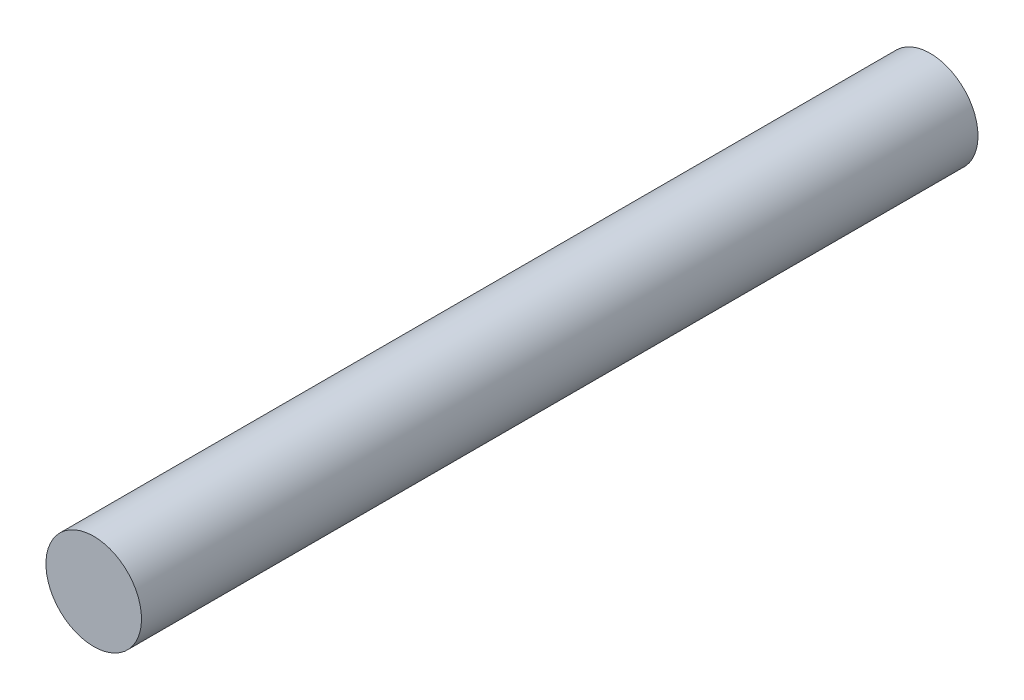
ISO-10303-21;
HEADER;
FILE_DESCRIPTION(('STEP AP214'),'2;1');
FILE_NAME('part.step','',(''),(''),'','','');
FILE_SCHEMA(('AUTOMOTIVE_DESIGN { 1 0 10303 214 1 1 1 1 }'));
ENDSEC;
DATA;
#1=APPLICATION_CONTEXT('core data for automotive mechanical design processes');
#2=APPLICATION_PROTOCOL_DEFINITION('international standard','automotive_design',2000,#1);
#3=PRODUCT_CONTEXT('',#1,'mechanical');
#4=PRODUCT('Part','Part','',(#3));
#5=PRODUCT_RELATED_PRODUCT_CATEGORY('part','',(#4));
#6=PRODUCT_DEFINITION_FORMATION('','',#4);
#7=PRODUCT_DEFINITION_CONTEXT('part definition',#1,'design');
#8=PRODUCT_DEFINITION('design','',#6,#7);
#9=PRODUCT_DEFINITION_SHAPE('','',#8);
#10=(LENGTH_UNIT() NAMED_UNIT(*) SI_UNIT(.MILLI.,.METRE.));
#11=(NAMED_UNIT(*) PLANE_ANGLE_UNIT() SI_UNIT($,.RADIAN.));
#12=(NAMED_UNIT(*) SI_UNIT($,.STERADIAN.) SOLID_ANGLE_UNIT());
#13=UNCERTAINTY_MEASURE_WITH_UNIT(LENGTH_MEASURE(1.E-05),#10,'distance_accuracy_value','');
#14=(GEOMETRIC_REPRESENTATION_CONTEXT(3) GLOBAL_UNCERTAINTY_ASSIGNED_CONTEXT((#13)) GLOBAL_UNIT_ASSIGNED_CONTEXT((#10,
#11,#12)) REPRESENTATION_CONTEXT('',''));
#15=CARTESIAN_POINT('',(0.,0.,0.));
#16=DIRECTION('',(0.,0.,1.));
#17=DIRECTION('',(1.,0.,0.));
#18=AXIS2_PLACEMENT_3D('',#15,#16,#17);
#19=CARTESIAN_POINT('',(0.,0.,70.));
#20=DIRECTION('',(0.,0.,-1.));
#21=DIRECTION('',(-1.,0.,0.));
#22=AXIS2_PLACEMENT_3D('',#19,#20,#21);
#23=CYLINDRICAL_SURFACE('',#22,4.);
#24=CARTESIAN_POINT('',(0.,0.,70.));
#25=DIRECTION('',(0.,0.,1.));
#26=DIRECTION('',(1.,0.,0.));
#27=AXIS2_PLACEMENT_3D('',#24,#25,#26);
#28=CIRCLE('',#27,4.);
#29=CARTESIAN_POINT('',(4.,0.,70.));
#30=VERTEX_POINT('',#29);
#31=EDGE_CURVE('E10',#30,#30,#28,.T.);
#32=ORIENTED_EDGE('',*,*,#31,.F.);
#33=EDGE_LOOP('',(#32));
#34=FACE_BOUND('',#33,.T.);
#35=CARTESIAN_POINT('',(0.,0.,0.));
#36=DIRECTION('',(0.,0.,1.));
#37=DIRECTION('',(1.,0.,0.));
#38=AXIS2_PLACEMENT_3D('',#35,#36,#37);
#39=CIRCLE('',#38,4.);
#40=CARTESIAN_POINT('',(4.,0.,0.));
#41=VERTEX_POINT('',#40);
#42=EDGE_CURVE('E33',#41,#41,#39,.T.);
#43=ORIENTED_EDGE('',*,*,#42,.T.);
#44=EDGE_LOOP('',(#43));
#45=FACE_BOUND('',#44,.T.);
#46=ADVANCED_FACE('F30',(#34,#45),#23,.T.);
#47=CARTESIAN_POINT('',(0.,0.,70.));
#48=DIRECTION('',(0.,0.,1.));
#49=DIRECTION('',(1.,0.,0.));
#50=AXIS2_PLACEMENT_3D('',#47,#48,#49);
#51=PLANE('',#50);
#52=ORIENTED_EDGE('',*,*,#31,.T.);
#53=EDGE_LOOP('',(#52));
#54=FACE_BOUND('',#53,.T.);
#55=ADVANCED_FACE('F45',(#54),#51,.T.);
#56=CARTESIAN_POINT('',(0.,0.,0.));
#57=DIRECTION('',(0.,0.,1.));
#58=DIRECTION('',(1.,0.,0.));
#59=AXIS2_PLACEMENT_3D('',#56,#57,#58);
#60=PLANE('',#59);
#61=ORIENTED_EDGE('',*,*,#42,.F.);
#62=EDGE_LOOP('',(#61));
#63=FACE_BOUND('',#62,.T.);
#64=ADVANCED_FACE('F43',(#63),#60,.F.);
#65=CLOSED_SHELL('',(#46,#55,#64));
#66=MANIFOLD_SOLID_BREP('B2',#65);
#67=ADVANCED_BREP_SHAPE_REPRESENTATION('',(#18,#66),#14);
#68=SHAPE_DEFINITION_REPRESENTATION(#9,#67);
ENDSEC;
END-ISO-10303-21;
